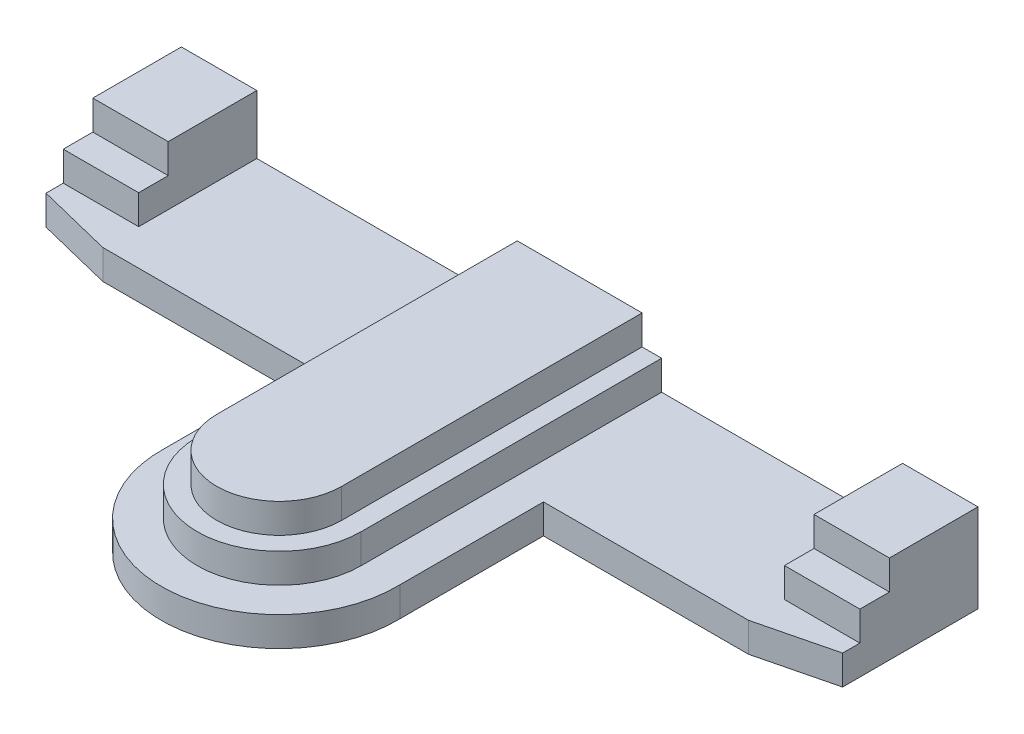
ISO-10303-21;
HEADER;
FILE_DESCRIPTION(('STEP AP214'),'2;1');
FILE_NAME('part.step','',(''),(''),'','','');
FILE_SCHEMA(('AUTOMOTIVE_DESIGN { 1 0 10303 214 1 1 1 1 }'));
ENDSEC;
DATA;
#1=APPLICATION_CONTEXT('core data for automotive mechanical design processes');
#2=APPLICATION_PROTOCOL_DEFINITION('international standard','automotive_design',2000,#1);
#3=PRODUCT_CONTEXT('',#1,'mechanical');
#4=PRODUCT('Part','Part','',(#3));
#5=PRODUCT_RELATED_PRODUCT_CATEGORY('part','',(#4));
#6=PRODUCT_DEFINITION_FORMATION('','',#4);
#7=PRODUCT_DEFINITION_CONTEXT('part definition',#1,'design');
#8=PRODUCT_DEFINITION('design','',#6,#7);
#9=PRODUCT_DEFINITION_SHAPE('','',#8);
#10=(LENGTH_UNIT() NAMED_UNIT(*) SI_UNIT(.MILLI.,.METRE.));
#11=(NAMED_UNIT(*) PLANE_ANGLE_UNIT() SI_UNIT($,.RADIAN.));
#12=(NAMED_UNIT(*) SI_UNIT($,.STERADIAN.) SOLID_ANGLE_UNIT());
#13=UNCERTAINTY_MEASURE_WITH_UNIT(LENGTH_MEASURE(1.E-05),#10,'distance_accuracy_value','');
#14=(GEOMETRIC_REPRESENTATION_CONTEXT(3) GLOBAL_UNCERTAINTY_ASSIGNED_CONTEXT((#13)) GLOBAL_UNIT_ASSIGNED_CONTEXT((#10,
#11,#12)) REPRESENTATION_CONTEXT('',''));
#15=CARTESIAN_POINT('',(0.,0.,0.));
#16=DIRECTION('',(0.,0.,1.));
#17=DIRECTION('',(1.,0.,0.));
#18=AXIS2_PLACEMENT_3D('',#15,#16,#17);
#19=CARTESIAN_POINT('',(59.1914661779905,-43.9359974390858,-29.7525439278961));
#20=DIRECTION('',(0.,0.,-1.));
#21=DIRECTION('',(-1.,0.,0.));
#22=AXIS2_PLACEMENT_3D('',#19,#20,#21);
#23=PLANE('',#22);
#24=DIRECTION('',(0.,-1.,0.));
#25=VECTOR('',#24,1.);
#26=CARTESIAN_POINT('',(-31.4865338220095,-43.9359974390858,-29.7525439278961));
#27=LINE('',#26,#25);
#28=CARTESIAN_POINT('',(-31.4865338220095,19.4497025609142,-29.7525439278961));
#29=VERTEX_POINT('',#28);
#30=CARTESIAN_POINT('',(-31.4865338220095,13.0997025609142,-29.7525439278961));
#31=VERTEX_POINT('',#30);
#32=EDGE_CURVE('E42',#29,#31,#27,.T.);
#33=ORIENTED_EDGE('',*,*,#32,.T.);
#34=DIRECTION('',(-1.,0.,0.));
#35=VECTOR('',#34,1.);
#36=CARTESIAN_POINT('',(-66.5385338220095,13.0997025609142,-29.7525439278961));
#37=LINE('',#36,#35);
#38=CARTESIAN_POINT('',(-5.51972883231249,13.0997025609142,-29.7525439278961));
#39=VERTEX_POINT('',#38);
#40=EDGE_CURVE('E248',#39,#31,#37,.T.);
#41=ORIENTED_EDGE('',*,*,#40,.F.);
#42=DIRECTION('',(0.,1.,0.));
#43=VECTOR('',#42,1.);
#44=CARTESIAN_POINT('',(-5.51972883231249,13.0997025609142,-29.7525439278961));
#45=LINE('',#44,#43);
#46=CARTESIAN_POINT('',(-5.51972883231249,16.2747025609142,-29.7525439278961));
#47=VERTEX_POINT('',#46);
#48=EDGE_CURVE('E350',#39,#47,#45,.T.);
#49=ORIENTED_EDGE('',*,*,#48,.T.);
#50=DIRECTION('',(-1.,0.,0.));
#51=VECTOR('',#50,1.);
#52=CARTESIAN_POINT('',(-66.5385338220095,16.2747025609142,-29.7525439278961));
#53=LINE('',#52,#51);
#54=CARTESIAN_POINT('',(-3.41520724280228,16.2747025609142,-29.7525439278961));
#55=VERTEX_POINT('',#54);
#56=EDGE_CURVE('E579',#55,#47,#53,.T.);
#57=ORIENTED_EDGE('',*,*,#56,.F.);
#58=DIRECTION('',(0.,1.,0.));
#59=VECTOR('',#58,1.);
#60=CARTESIAN_POINT('',(-3.41520724280227,-43.9359974390858,-29.7525439278961));
#61=LINE('',#60,#59);
#62=CARTESIAN_POINT('',(-3.41520724280225,19.4497025609142,-29.7525439278961));
#63=VERTEX_POINT('',#62);
#64=EDGE_CURVE('E554',#55,#63,#61,.T.);
#65=ORIENTED_EDGE('',*,*,#64,.T.);
#66=DIRECTION('',(-1.,0.,0.));
#67=VECTOR('',#66,1.);
#68=CARTESIAN_POINT('',(59.1914661779905,19.4497025609142,-29.7525439278961));
#69=LINE('',#68,#67);
#70=CARTESIAN_POINT('',(10.0381395987833,19.4497025609142,-29.7525439278961));
#71=VERTEX_POINT('',#70);
#72=EDGE_CURVE('E552',#71,#63,#69,.T.);
#73=ORIENTED_EDGE('',*,*,#72,.F.);
#74=DIRECTION('',(0.,1.,0.));
#75=VECTOR('',#74,1.);
#76=CARTESIAN_POINT('',(10.0381395987833,16.2747025609142,-29.7525439278961));
#77=LINE('',#76,#75);
#78=CARTESIAN_POINT('',(10.0381395987833,16.2747025609142,-29.7525439278961));
#79=VERTEX_POINT('',#78);
#80=EDGE_CURVE('E567',#79,#71,#77,.T.);
#81=ORIENTED_EDGE('',*,*,#80,.F.);
#82=CARTESIAN_POINT('',(12.1426611882934,16.2747025609142,-29.7525439278961));
#83=VERTEX_POINT('',#82);
#84=EDGE_CURVE('E608',#83,#79,#53,.T.);
#85=ORIENTED_EDGE('',*,*,#84,.F.);
#86=DIRECTION('',(0.,1.,0.));
#87=VECTOR('',#86,1.);
#88=CARTESIAN_POINT('',(12.1426611882934,13.0997025609142,-29.7525439278961));
#89=LINE('',#88,#87);
#90=CARTESIAN_POINT('',(12.1426611882934,13.0997025609142,-29.7525439278961));
#91=VERTEX_POINT('',#90);
#92=EDGE_CURVE('E611',#91,#83,#89,.T.);
#93=ORIENTED_EDGE('',*,*,#92,.F.);
#94=CARTESIAN_POINT('',(38.1094661779905,13.0997025609142,-29.7525439278961));
#95=VERTEX_POINT('',#94);
#96=EDGE_CURVE('E252',#95,#91,#37,.T.);
#97=ORIENTED_EDGE('',*,*,#96,.F.);
#98=DIRECTION('',(0.,1.,0.));
#99=VECTOR('',#98,1.);
#100=CARTESIAN_POINT('',(38.1094661779905,-43.9359974390858,-29.7525439278961));
#101=LINE('',#100,#99);
#102=CARTESIAN_POINT('',(38.1094661779905,19.4497025609142,-29.7525439278961));
#103=VERTEX_POINT('',#102);
#104=EDGE_CURVE('E349',#95,#103,#101,.T.);
#105=ORIENTED_EDGE('',*,*,#104,.T.);
#106=DIRECTION('',(-1.,0.,0.));
#107=VECTOR('',#106,1.);
#108=CARTESIAN_POINT('',(59.1914661779905,19.4497025609142,-29.7525439278961));
#109=LINE('',#108,#107);
#110=CARTESIAN_POINT('',(46.2374661779905,19.4497025609142,-29.7525439278961));
#111=VERTEX_POINT('',#110);
#112=EDGE_CURVE('E351',#111,#103,#109,.T.);
#113=ORIENTED_EDGE('',*,*,#112,.F.);
#114=DIRECTION('',(0.,1.,0.));
#115=VECTOR('',#114,1.);
#116=CARTESIAN_POINT('',(46.2374661779905,16.2747025609142,-29.7525439278961));
#117=LINE('',#116,#115);
#118=CARTESIAN_POINT('',(46.2374661779905,9.92470256091423,-29.7525439278961));
#119=VERTEX_POINT('',#118);
#120=EDGE_CURVE('E346',#119,#111,#117,.T.);
#121=ORIENTED_EDGE('',*,*,#120,.F.);
#122=DIRECTION('',(1.,0.,0.));
#123=VECTOR('',#122,1.);
#124=CARTESIAN_POINT('',(59.1914661779905,9.9247025609142,-29.7525439278961));
#125=LINE('',#124,#123);
#126=CARTESIAN_POINT('',(-39.6145338220095,9.92470256091423,-29.7525439278961));
#127=VERTEX_POINT('',#126);
#128=EDGE_CURVE('E467',#127,#119,#125,.T.);
#129=ORIENTED_EDGE('',*,*,#128,.F.);
#130=DIRECTION('',(0.,1.,0.));
#131=VECTOR('',#130,1.);
#132=CARTESIAN_POINT('',(-39.6145338220095,-43.9359974390858,-29.7525439278961));
#133=LINE('',#132,#131);
#134=CARTESIAN_POINT('',(-39.6145338220095,19.4497025609142,-29.7525439278961));
#135=VERTEX_POINT('',#134);
#136=EDGE_CURVE('E458',#127,#135,#133,.T.);
#137=ORIENTED_EDGE('',*,*,#136,.T.);
#138=DIRECTION('',(-1.,0.,0.));
#139=VECTOR('',#138,1.);
#140=CARTESIAN_POINT('',(59.1914661779905,19.4497025609142,-29.7525439278961));
#141=LINE('',#140,#139);
#142=EDGE_CURVE('E11',#29,#135,#141,.T.);
#143=ORIENTED_EDGE('',*,*,#142,.F.);
#144=EDGE_LOOP('',(#33,#41,#49,#57,#65,#73,#81,#85,#93,#97,#105,#113,#121,#129,#137,#143));
#145=FACE_BOUND('',#144,.T.);
#146=ADVANCED_FACE('F34',(#145),#23,.T.);
#147=CARTESIAN_POINT('',(-31.4865338220095,16.2747025609142,-29.7525439278961));
#148=DIRECTION('',(1.,0.,0.));
#149=DIRECTION('',(0.,0.,-1.));
#150=AXIS2_PLACEMENT_3D('',#147,#148,#149);
#151=PLANE('',#150);
#152=DIRECTION('',(0.,1.,0.));
#153=VECTOR('',#152,1.);
#154=CARTESIAN_POINT('',(-31.4865338220095,16.2747025609142,-20.2064007276293));
#155=LINE('',#154,#153);
#156=CARTESIAN_POINT('',(-31.4865338220095,16.2747025609142,-20.2064007276293));
#157=VERTEX_POINT('',#156);
#158=CARTESIAN_POINT('',(-31.4865338220095,19.4497025609142,-20.2064007276022));
#159=VERTEX_POINT('',#158);
#160=EDGE_CURVE('E538',#157,#159,#155,.T.);
#161=ORIENTED_EDGE('',*,*,#160,.F.);
#162=DIRECTION('',(0.,0.,-1.));
#163=VECTOR('',#162,1.);
#164=CARTESIAN_POINT('',(-31.4865338220095,16.2747025609142,-29.7525439278961));
#165=LINE('',#164,#163);
#166=CARTESIAN_POINT('',(-31.4865338220095,16.2747025609142,-17.0208335164863));
#167=VERTEX_POINT('',#166);
#168=EDGE_CURVE('E50',#167,#157,#165,.T.);
#169=ORIENTED_EDGE('',*,*,#168,.F.);
#170=DIRECTION('',(0.,1.,0.));
#171=VECTOR('',#170,1.);
#172=CARTESIAN_POINT('',(-31.4865338220095,13.0997025609142,-17.0208335164863));
#173=LINE('',#172,#171);
#174=CARTESIAN_POINT('',(-31.4865338220095,13.0997025609142,-17.0208335164863));
#175=VERTEX_POINT('',#174);
#176=EDGE_CURVE('E512',#175,#167,#173,.T.);
#177=ORIENTED_EDGE('',*,*,#176,.F.);
#178=DIRECTION('',(0.,0.,-1.));
#179=VECTOR('',#178,1.);
#180=CARTESIAN_POINT('',(-31.4865338220095,13.0997025609142,-29.7525439278961));
#181=LINE('',#180,#179);
#182=EDGE_CURVE('E520',#175,#31,#181,.T.);
#183=ORIENTED_EDGE('',*,*,#182,.T.);
#184=ORIENTED_EDGE('',*,*,#32,.F.);
#185=DIRECTION('',(0.,0.,1.));
#186=VECTOR('',#185,1.);
#187=CARTESIAN_POINT('',(-31.4865338220095,19.4497025609142,500000.));
#188=LINE('',#187,#186);
#189=EDGE_CURVE('E545',#29,#159,#188,.T.);
#190=ORIENTED_EDGE('',*,*,#189,.T.);
#191=EDGE_LOOP('',(#161,#169,#177,#183,#184,#190));
#192=FACE_BOUND('',#191,.T.);
#193=ADVANCED_FACE('F451',(#192),#151,.T.);
#194=CARTESIAN_POINT('',(-39.6145338220095,16.2747025609142,-20.2064007276293));
#195=DIRECTION('',(-1.,0.,0.));
#196=DIRECTION('',(0.,0.,1.));
#197=AXIS2_PLACEMENT_3D('',#194,#195,#196);
#198=PLANE('',#197);
#199=ORIENTED_EDGE('',*,*,#136,.F.);
#200=DIRECTION('',(0.,0.,1.));
#201=VECTOR('',#200,1.);
#202=CARTESIAN_POINT('',(-39.6145338220095,9.92470256091422,-15.1613548056895));
#203=LINE('',#202,#201);
#204=CARTESIAN_POINT('',(-39.6145338220095,9.92470256091422,-15.1613548056895));
#205=VERTEX_POINT('',#204);
#206=EDGE_CURVE('E293',#127,#205,#203,.T.);
#207=ORIENTED_EDGE('',*,*,#206,.T.);
#208=DIRECTION('',(0.,1.,0.));
#209=VECTOR('',#208,1.);
#210=CARTESIAN_POINT('',(-39.6145338220095,9.92470256091422,-15.1613548056895));
#211=LINE('',#210,#209);
#212=CARTESIAN_POINT('',(-39.6145338220095,13.0997025609142,-15.1613548056895));
#213=VERTEX_POINT('',#212);
#214=EDGE_CURVE('E290',#205,#213,#211,.T.);
#215=ORIENTED_EDGE('',*,*,#214,.T.);
#216=DIRECTION('',(0.,0.,1.));
#217=VECTOR('',#216,1.);
#218=CARTESIAN_POINT('',(-39.6145338220095,13.0997025609142,-15.1613548056895));
#219=LINE('',#218,#217);
#220=CARTESIAN_POINT('',(-39.6145338220095,13.0997025609142,-17.0208335164863));
#221=VERTEX_POINT('',#220);
#222=EDGE_CURVE('E470',#221,#213,#219,.T.);
#223=ORIENTED_EDGE('',*,*,#222,.F.);
#224=DIRECTION('',(0.,1.,0.));
#225=VECTOR('',#224,1.);
#226=CARTESIAN_POINT('',(-39.6145338220095,13.0997025609142,-17.0208335164863));
#227=LINE('',#226,#225);
#228=CARTESIAN_POINT('',(-39.6145338220095,16.2747025609142,-17.0208335164863));
#229=VERTEX_POINT('',#228);
#230=EDGE_CURVE('E499',#221,#229,#227,.T.);
#231=ORIENTED_EDGE('',*,*,#230,.T.);
#232=DIRECTION('',(0.,0.,1.));
#233=VECTOR('',#232,1.);
#234=CARTESIAN_POINT('',(-39.6145338220095,16.2747025609142,-17.0208335164863));
#235=LINE('',#234,#233);
#236=CARTESIAN_POINT('',(-39.6145338220095,16.2747025609142,-20.2064007276293));
#237=VERTEX_POINT('',#236);
#238=EDGE_CURVE('E525',#237,#229,#235,.T.);
#239=ORIENTED_EDGE('',*,*,#238,.F.);
#240=DIRECTION('',(0.,1.,0.));
#241=VECTOR('',#240,1.);
#242=CARTESIAN_POINT('',(-39.6145338220095,16.2747025609142,-20.2064007276293));
#243=LINE('',#242,#241);
#244=CARTESIAN_POINT('',(-39.6145338220095,19.4497025609142,-20.2064007276022));
#245=VERTEX_POINT('',#244);
#246=EDGE_CURVE('E542',#237,#245,#243,.T.);
#247=ORIENTED_EDGE('',*,*,#246,.T.);
#248=DIRECTION('',(0.,0.,1.));
#249=VECTOR('',#248,1.);
#250=CARTESIAN_POINT('',(-39.6145338220095,19.4497025609142,-20.2064007276293));
#251=LINE('',#250,#249);
#252=EDGE_CURVE('E462',#135,#245,#251,.T.);
#253=ORIENTED_EDGE('',*,*,#252,.F.);
#254=EDGE_LOOP('',(#199,#207,#215,#223,#231,#239,#247,#253));
#255=FACE_BOUND('',#254,.T.);
#256=ADVANCED_FACE('F446',(#255),#198,.T.);
#257=CARTESIAN_POINT('',(-38.8525338220095,16.2747025609142,-20.2064007276293));
#258=DIRECTION('',(0.,0.,1.));
#259=DIRECTION('',(1.,0.,0.));
#260=AXIS2_PLACEMENT_3D('',#257,#258,#259);
#261=PLANE('',#260);
#262=DIRECTION('',(-1.,0.,0.));
#263=VECTOR('',#262,1.);
#264=CARTESIAN_POINT('',(59.1914661779905,19.4497025609142,-20.2064007276022));
#265=LINE('',#264,#263);
#266=EDGE_CURVE('E547',#159,#245,#265,.T.);
#267=ORIENTED_EDGE('',*,*,#266,.T.);
#268=ORIENTED_EDGE('',*,*,#246,.F.);
#269=DIRECTION('',(1.,0.,0.));
#270=VECTOR('',#269,1.);
#271=CARTESIAN_POINT('',(-38.8525338220095,16.2747025609142,-20.2064007276293));
#272=LINE('',#271,#270);
#273=EDGE_CURVE('E543',#237,#157,#272,.T.);
#274=ORIENTED_EDGE('',*,*,#273,.T.);
#275=ORIENTED_EDGE('',*,*,#160,.T.);
#276=EDGE_LOOP('',(#267,#268,#274,#275));
#277=FACE_BOUND('',#276,.T.);
#278=ADVANCED_FACE('F434',(#277),#261,.T.);
#279=CARTESIAN_POINT('',(59.1914661779905,19.4497025609142,500000.));
#280=DIRECTION('',(0.,-1.,0.));
#281=DIRECTION('',(1.,0.,0.));
#282=AXIS2_PLACEMENT_3D('',#279,#280,#281);
#283=PLANE('',#282);
#284=ORIENTED_EDGE('',*,*,#142,.T.);
#285=ORIENTED_EDGE('',*,*,#252,.T.);
#286=ORIENTED_EDGE('',*,*,#266,.F.);
#287=ORIENTED_EDGE('',*,*,#189,.F.);
#288=EDGE_LOOP('',(#284,#285,#286,#287));
#289=FACE_BOUND('',#288,.T.);
#290=ADVANCED_FACE('F431',(#289),#283,.F.);
#291=CARTESIAN_POINT('',(59.1914661779905,19.4497025609142,500000.));
#292=DIRECTION('',(0.,-1.,0.));
#293=DIRECTION('',(1.,0.,0.));
#294=AXIS2_PLACEMENT_3D('',#291,#292,#293);
#295=PLANE('',#294);
#296=DIRECTION('',(0.,0.,-1.));
#297=VECTOR('',#296,1.);
#298=CARTESIAN_POINT('',(10.0381395987833,19.4497025609142,2.63245607210388));
#299=LINE('',#298,#297);
#300=CARTESIAN_POINT('',(10.0381395987833,19.4497025609142,2.63245607210388));
#301=VERTEX_POINT('',#300);
#302=EDGE_CURVE('E558',#71,#301,#299,.F.);
#303=ORIENTED_EDGE('',*,*,#302,.F.);
#304=ORIENTED_EDGE('',*,*,#72,.T.);
#305=DIRECTION('',(0.,0.,-1.));
#306=VECTOR('',#305,1.);
#307=CARTESIAN_POINT('',(-3.41520724280228,19.4497025609142,2.63245607210388));
#308=LINE('',#307,#306);
#309=CARTESIAN_POINT('',(-3.41520724280227,19.4497025609142,2.63245607210388));
#310=VERTEX_POINT('',#309);
#311=EDGE_CURVE('E562',#310,#63,#308,.T.);
#312=ORIENTED_EDGE('',*,*,#311,.F.);
#313=CARTESIAN_POINT('',(3.3114661779905,19.4497025609142,2.63245607210388));
#314=DIRECTION('',(0.,1.,0.));
#315=DIRECTION('',(0.,0.,1.));
#316=AXIS2_PLACEMENT_3D('',#313,#314,#315);
#317=CIRCLE('',#316,6.72667342079277);
#318=EDGE_CURVE('E574',#301,#310,#317,.F.);
#319=ORIENTED_EDGE('',*,*,#318,.F.);
#320=EDGE_LOOP('',(#303,#304,#312,#319));
#321=FACE_BOUND('',#320,.T.);
#322=ADVANCED_FACE('F433',(#321),#295,.F.);
#323=CARTESIAN_POINT('',(10.0381395987833,16.2747025609142,2.63245607210388));
#324=DIRECTION('',(1.,0.,0.));
#325=DIRECTION('',(0.,0.,-1.));
#326=AXIS2_PLACEMENT_3D('',#323,#324,#325);
#327=PLANE('',#326);
#328=ORIENTED_EDGE('',*,*,#302,.T.);
#329=DIRECTION('',(0.,1.,0.));
#330=VECTOR('',#329,1.);
#331=CARTESIAN_POINT('',(10.0381395987833,16.2747025609142,2.63245607210388));
#332=LINE('',#331,#330);
#333=CARTESIAN_POINT('',(10.0381395987833,16.2747025609142,2.63245607210388));
#334=VERTEX_POINT('',#333);
#335=EDGE_CURVE('E510',#334,#301,#332,.T.);
#336=ORIENTED_EDGE('',*,*,#335,.F.);
#337=DIRECTION('',(0.,0.,-1.));
#338=VECTOR('',#337,1.);
#339=CARTESIAN_POINT('',(10.0381395987833,16.2747025609142,2.63245607210388));
#340=LINE('',#339,#338);
#341=EDGE_CURVE('E507',#334,#79,#340,.T.);
#342=ORIENTED_EDGE('',*,*,#341,.T.);
#343=ORIENTED_EDGE('',*,*,#80,.T.);
#344=EDGE_LOOP('',(#328,#336,#342,#343));
#345=FACE_BOUND('',#344,.T.);
#346=ADVANCED_FACE('F441',(#345),#327,.T.);
#347=CARTESIAN_POINT('',(-3.41520724280228,16.2747025609142,-29.7525439278961));
#348=DIRECTION('',(-1.,0.,0.));
#349=DIRECTION('',(0.,0.,1.));
#350=AXIS2_PLACEMENT_3D('',#347,#348,#349);
#351=PLANE('',#350);
#352=ORIENTED_EDGE('',*,*,#311,.T.);
#353=ORIENTED_EDGE('',*,*,#64,.F.);
#354=DIRECTION('',(0.,0.,1.));
#355=VECTOR('',#354,1.);
#356=CARTESIAN_POINT('',(-3.41520724280228,16.2747025609142,-29.7525439278961));
#357=LINE('',#356,#355);
#358=CARTESIAN_POINT('',(-3.41520724280227,16.2747025609142,2.63245607210388));
#359=VERTEX_POINT('',#358);
#360=EDGE_CURVE('E569',#55,#359,#357,.T.);
#361=ORIENTED_EDGE('',*,*,#360,.T.);
#362=DIRECTION('',(0.,1.,0.));
#363=VECTOR('',#362,1.);
#364=CARTESIAN_POINT('',(-3.41520724280227,16.2747025609142,2.63245607210388));
#365=LINE('',#364,#363);
#366=EDGE_CURVE('E585',#359,#310,#365,.T.);
#367=ORIENTED_EDGE('',*,*,#366,.T.);
#368=EDGE_LOOP('',(#352,#353,#361,#367));
#369=FACE_BOUND('',#368,.T.);
#370=ADVANCED_FACE('F605',(#369),#351,.T.);
#371=CARTESIAN_POINT('',(3.3114661779905,16.2747025609142,2.63245607210388));
#372=DIRECTION('',(0.,1.,0.));
#373=DIRECTION('',(0.,0.,1.));
#374=AXIS2_PLACEMENT_3D('',#371,#372,#373);
#375=CYLINDRICAL_SURFACE('',#374,6.72667342079278);
#376=ORIENTED_EDGE('',*,*,#318,.T.);
#377=ORIENTED_EDGE('',*,*,#366,.F.);
#378=CARTESIAN_POINT('',(3.3114661779905,16.2747025609142,2.63245607210388));
#379=DIRECTION('',(0.,1.,0.));
#380=DIRECTION('',(0.,0.,1.));
#381=AXIS2_PLACEMENT_3D('',#378,#379,#380);
#382=CIRCLE('',#381,6.72667342079278);
#383=EDGE_CURVE('E588',#359,#334,#382,.T.);
#384=ORIENTED_EDGE('',*,*,#383,.T.);
#385=ORIENTED_EDGE('',*,*,#335,.T.);
#386=EDGE_LOOP('',(#376,#377,#384,#385));
#387=FACE_BOUND('',#386,.T.);
#388=ADVANCED_FACE('F445',(#387),#375,.T.);
#389=CARTESIAN_POINT('',(-58.3130040874096,16.2747025609142,26.1374810721039));
#390=DIRECTION('',(0.,1.,0.));
#391=DIRECTION('',(0.,0.,1.));
#392=AXIS2_PLACEMENT_3D('',#389,#390,#391);
#393=PLANE('',#392);
#394=ORIENTED_EDGE('',*,*,#168,.T.);
#395=ORIENTED_EDGE('',*,*,#273,.F.);
#396=ORIENTED_EDGE('',*,*,#238,.T.);
#397=DIRECTION('',(-1.,0.,0.));
#398=VECTOR('',#397,1.);
#399=CARTESIAN_POINT('',(-32.2485338220095,16.2747025609142,-17.0208335164863));
#400=LINE('',#399,#398);
#401=EDGE_CURVE('E506',#167,#229,#400,.T.);
#402=ORIENTED_EDGE('',*,*,#401,.F.);
#403=EDGE_LOOP('',(#394,#395,#396,#402));
#404=FACE_BOUND('',#403,.T.);
#405=ADVANCED_FACE('F444',(#404),#393,.T.);
#406=CARTESIAN_POINT('',(-38.8525338220095,13.0997025609142,-17.0208335164863));
#407=DIRECTION('',(0.,0.,1.));
#408=DIRECTION('',(1.,0.,0.));
#409=AXIS2_PLACEMENT_3D('',#406,#407,#408);
#410=PLANE('',#409);
#411=ORIENTED_EDGE('',*,*,#401,.T.);
#412=ORIENTED_EDGE('',*,*,#230,.F.);
#413=DIRECTION('',(1.,0.,0.));
#414=VECTOR('',#413,1.);
#415=CARTESIAN_POINT('',(-38.8525338220095,13.0997025609142,-17.0208335164863));
#416=LINE('',#415,#414);
#417=EDGE_CURVE('E504',#221,#175,#416,.T.);
#418=ORIENTED_EDGE('',*,*,#417,.T.);
#419=ORIENTED_EDGE('',*,*,#176,.T.);
#420=EDGE_LOOP('',(#411,#412,#418,#419));
#421=FACE_BOUND('',#420,.T.);
#422=ADVANCED_FACE('F503',(#421),#410,.T.);
#423=CARTESIAN_POINT('',(38.1094661779905,16.2747025609142,-29.7525439278961));
#424=DIRECTION('',(-1.,0.,0.));
#425=DIRECTION('',(0.,0.,1.));
#426=AXIS2_PLACEMENT_3D('',#423,#424,#425);
#427=PLANE('',#426);
#428=ORIENTED_EDGE('',*,*,#104,.F.);
#429=DIRECTION('',(0.,0.,1.));
#430=VECTOR('',#429,1.);
#431=CARTESIAN_POINT('',(38.1094661779905,13.0997025609142,-29.7525439278961));
#432=LINE('',#431,#430);
#433=CARTESIAN_POINT('',(38.1094661779905,13.0997025609142,-17.0208335164863));
#434=VERTEX_POINT('',#433);
#435=EDGE_CURVE('E305',#95,#434,#432,.T.);
#436=ORIENTED_EDGE('',*,*,#435,.T.);
#437=DIRECTION('',(0.,1.,0.));
#438=VECTOR('',#437,1.);
#439=CARTESIAN_POINT('',(38.1094661779905,13.0997025609142,-17.0208335164863));
#440=LINE('',#439,#438);
#441=CARTESIAN_POINT('',(38.1094661779905,16.2747025609142,-17.0208335164863));
#442=VERTEX_POINT('',#441);
#443=EDGE_CURVE('E345',#434,#442,#440,.T.);
#444=ORIENTED_EDGE('',*,*,#443,.T.);
#445=DIRECTION('',(0.,0.,1.));
#446=VECTOR('',#445,1.);
#447=CARTESIAN_POINT('',(38.1094661779905,16.2747025609142,-29.7525439278961));
#448=LINE('',#447,#446);
#449=CARTESIAN_POINT('',(38.1094661779905,16.2747025609142,-20.2064007276293));
#450=VERTEX_POINT('',#449);
#451=EDGE_CURVE('E310',#450,#442,#448,.T.);
#452=ORIENTED_EDGE('',*,*,#451,.F.);
#453=DIRECTION('',(0.,1.,0.));
#454=VECTOR('',#453,1.);
#455=CARTESIAN_POINT('',(38.1094661779905,16.2747025609142,-20.2064007276293));
#456=LINE('',#455,#454);
#457=CARTESIAN_POINT('',(38.1094661779905,19.4497025609142,-20.2064007276293));
#458=VERTEX_POINT('',#457);
#459=EDGE_CURVE('E365',#450,#458,#456,.T.);
#460=ORIENTED_EDGE('',*,*,#459,.T.);
#461=DIRECTION('',(0.,0.,1.));
#462=VECTOR('',#461,1.);
#463=CARTESIAN_POINT('',(38.1094661779905,19.4497025609142,-29.7525439278961));
#464=LINE('',#463,#462);
#465=EDGE_CURVE('E369',#103,#458,#464,.T.);
#466=ORIENTED_EDGE('',*,*,#465,.F.);
#467=EDGE_LOOP('',(#428,#436,#444,#452,#460,#466));
#468=FACE_BOUND('',#467,.T.);
#469=ADVANCED_FACE('F385',(#468),#427,.T.);
#470=CARTESIAN_POINT('',(38.8714661779905,16.2747025609142,-20.2064007276293));
#471=DIRECTION('',(0.,0.,1.));
#472=DIRECTION('',(1.,0.,0.));
#473=AXIS2_PLACEMENT_3D('',#470,#471,#472);
#474=PLANE('',#473);
#475=DIRECTION('',(1.,0.,0.));
#476=VECTOR('',#475,1.);
#477=CARTESIAN_POINT('',(38.8714661779905,19.4497025609142,-20.2064007276293));
#478=LINE('',#477,#476);
#479=CARTESIAN_POINT('',(46.2374661779905,19.4497025609142,-20.2064007276293));
#480=VERTEX_POINT('',#479);
#481=EDGE_CURVE('E374',#458,#480,#478,.T.);
#482=ORIENTED_EDGE('',*,*,#481,.F.);
#483=ORIENTED_EDGE('',*,*,#459,.F.);
#484=DIRECTION('',(1.,0.,0.));
#485=VECTOR('',#484,1.);
#486=CARTESIAN_POINT('',(38.8714661779905,16.2747025609142,-20.2064007276293));
#487=LINE('',#486,#485);
#488=CARTESIAN_POINT('',(46.2374661779905,16.2747025609142,-20.2064007276293));
#489=VERTEX_POINT('',#488);
#490=EDGE_CURVE('E362',#450,#489,#487,.T.);
#491=ORIENTED_EDGE('',*,*,#490,.T.);
#492=DIRECTION('',(0.,1.,0.));
#493=VECTOR('',#492,1.);
#494=CARTESIAN_POINT('',(46.2374661779905,16.2747025609142,-20.2064007276293));
#495=LINE('',#494,#493);
#496=EDGE_CURVE('E366',#489,#480,#495,.T.);
#497=ORIENTED_EDGE('',*,*,#496,.T.);
#498=EDGE_LOOP('',(#482,#483,#491,#497));
#499=FACE_BOUND('',#498,.T.);
#500=ADVANCED_FACE('F390',(#499),#474,.T.);
#501=CARTESIAN_POINT('',(46.2374661779905,16.2747025609142,-20.2064007276293));
#502=DIRECTION('',(1.,0.,0.));
#503=DIRECTION('',(0.,0.,-1.));
#504=AXIS2_PLACEMENT_3D('',#501,#502,#503);
#505=PLANE('',#504);
#506=ORIENTED_EDGE('',*,*,#496,.F.);
#507=DIRECTION('',(0.,0.,-1.));
#508=VECTOR('',#507,1.);
#509=CARTESIAN_POINT('',(46.2374661779905,16.2747025609142,-17.0208335164863));
#510=LINE('',#509,#508);
#511=CARTESIAN_POINT('',(46.2374661779905,16.2747025609142,-17.0208335164863));
#512=VERTEX_POINT('',#511);
#513=EDGE_CURVE('E407',#512,#489,#510,.T.);
#514=ORIENTED_EDGE('',*,*,#513,.F.);
#515=DIRECTION('',(0.,1.,0.));
#516=VECTOR('',#515,1.);
#517=CARTESIAN_POINT('',(46.2374661779905,13.0997025609142,-17.0208335164863));
#518=LINE('',#517,#516);
#519=CARTESIAN_POINT('',(46.2374661779905,13.0997025609142,-17.0208335164863));
#520=VERTEX_POINT('',#519);
#521=EDGE_CURVE('E311',#520,#512,#518,.T.);
#522=ORIENTED_EDGE('',*,*,#521,.F.);
#523=DIRECTION('',(0.,0.,-1.));
#524=VECTOR('',#523,1.);
#525=CARTESIAN_POINT('',(46.2374661779905,13.0997025609142,-15.1613548056895));
#526=LINE('',#525,#524);
#527=CARTESIAN_POINT('',(46.2374661779905,13.0997025609142,-15.1613548056895));
#528=VERTEX_POINT('',#527);
#529=EDGE_CURVE('E287',#528,#520,#526,.T.);
#530=ORIENTED_EDGE('',*,*,#529,.F.);
#531=DIRECTION('',(0.,1.,0.));
#532=VECTOR('',#531,1.);
#533=CARTESIAN_POINT('',(46.2374661779905,9.92470256091422,-15.1613548056895));
#534=LINE('',#533,#532);
#535=CARTESIAN_POINT('',(46.2374661779905,9.92470256091422,-15.1613548056895));
#536=VERTEX_POINT('',#535);
#537=EDGE_CURVE('E268',#536,#528,#534,.T.);
#538=ORIENTED_EDGE('',*,*,#537,.F.);
#539=DIRECTION('',(0.,0.,-1.));
#540=VECTOR('',#539,1.);
#541=CARTESIAN_POINT('',(46.2374661779905,9.92470256091422,-15.1613548056895));
#542=LINE('',#541,#540);
#543=EDGE_CURVE('E271',#536,#119,#542,.T.);
#544=ORIENTED_EDGE('',*,*,#543,.T.);
#545=ORIENTED_EDGE('',*,*,#120,.T.);
#546=DIRECTION('',(0.,0.,-1.));
#547=VECTOR('',#546,1.);
#548=CARTESIAN_POINT('',(46.2374661779905,19.4497025609142,-20.2064007276293));
#549=LINE('',#548,#547);
#550=EDGE_CURVE('E370',#480,#111,#549,.T.);
#551=ORIENTED_EDGE('',*,*,#550,.F.);
#552=EDGE_LOOP('',(#506,#514,#522,#530,#538,#544,#545,#551));
#553=FACE_BOUND('',#552,.T.);
#554=ADVANCED_FACE('F405',(#553),#505,.T.);
#555=CARTESIAN_POINT('',(59.1914661779905,19.4497025609142,500000.));
#556=DIRECTION('',(0.,-1.,0.));
#557=DIRECTION('',(1.,0.,0.));
#558=AXIS2_PLACEMENT_3D('',#555,#556,#557);
#559=PLANE('',#558);
#560=ORIENTED_EDGE('',*,*,#112,.T.);
#561=ORIENTED_EDGE('',*,*,#465,.T.);
#562=ORIENTED_EDGE('',*,*,#481,.T.);
#563=ORIENTED_EDGE('',*,*,#550,.T.);
#564=EDGE_LOOP('',(#560,#561,#562,#563));
#565=FACE_BOUND('',#564,.T.);
#566=ADVANCED_FACE('F379',(#565),#559,.F.);
#567=CARTESIAN_POINT('',(12.1426611882934,13.0997025609142,2.63245607210388));
#568=DIRECTION('',(1.,0.,0.));
#569=DIRECTION('',(0.,0.,-1.));
#570=AXIS2_PLACEMENT_3D('',#567,#568,#569);
#571=PLANE('',#570);
#572=DIRECTION('',(0.,0.,-1.));
#573=VECTOR('',#572,1.);
#574=CARTESIAN_POINT('',(12.1426611882934,16.2747025609142,2.63245607210388));
#575=LINE('',#574,#573);
#576=CARTESIAN_POINT('',(12.1426611882934,16.2747025609142,2.63245607210388));
#577=VERTEX_POINT('',#576);
#578=EDGE_CURVE('E323',#83,#577,#575,.F.);
#579=ORIENTED_EDGE('',*,*,#578,.T.);
#580=DIRECTION('',(0.,1.,0.));
#581=VECTOR('',#580,1.);
#582=CARTESIAN_POINT('',(12.1426611882934,13.0997025609142,2.63245607210388));
#583=LINE('',#582,#581);
#584=CARTESIAN_POINT('',(12.1426611882934,13.0997025609142,2.63245607210388));
#585=VERTEX_POINT('',#584);
#586=EDGE_CURVE('E613',#585,#577,#583,.T.);
#587=ORIENTED_EDGE('',*,*,#586,.F.);
#588=DIRECTION('',(0.,0.,-1.));
#589=VECTOR('',#588,1.);
#590=CARTESIAN_POINT('',(12.1426611882934,13.0997025609142,2.63245607210388));
#591=LINE('',#590,#589);
#592=EDGE_CURVE('E328',#585,#91,#591,.T.);
#593=ORIENTED_EDGE('',*,*,#592,.T.);
#594=ORIENTED_EDGE('',*,*,#92,.T.);
#595=EDGE_LOOP('',(#579,#587,#593,#594));
#596=FACE_BOUND('',#595,.T.);
#597=ADVANCED_FACE('F418',(#596),#571,.T.);
#598=CARTESIAN_POINT('',(-5.51972883231249,13.0997025609142,-29.7525439278961));
#599=DIRECTION('',(-1.,0.,0.));
#600=DIRECTION('',(0.,0.,1.));
#601=AXIS2_PLACEMENT_3D('',#598,#599,#600);
#602=PLANE('',#601);
#603=DIRECTION('',(0.,0.,-1.));
#604=VECTOR('',#603,1.);
#605=CARTESIAN_POINT('',(-5.51972883231249,16.2747025609142,2.63245607210388));
#606=LINE('',#605,#604);
#607=CARTESIAN_POINT('',(-5.51972883231248,16.2747025609142,2.63245607210388));
#608=VERTEX_POINT('',#607);
#609=EDGE_CURVE('E329',#608,#47,#606,.T.);
#610=ORIENTED_EDGE('',*,*,#609,.T.);
#611=ORIENTED_EDGE('',*,*,#48,.F.);
#612=DIRECTION('',(0.,0.,1.));
#613=VECTOR('',#612,1.);
#614=CARTESIAN_POINT('',(-5.51972883231249,13.0997025609142,-29.7525439278961));
#615=LINE('',#614,#613);
#616=CARTESIAN_POINT('',(-5.51972883231248,13.0997025609142,2.63245607210388));
#617=VERTEX_POINT('',#616);
#618=EDGE_CURVE('E335',#39,#617,#615,.T.);
#619=ORIENTED_EDGE('',*,*,#618,.T.);
#620=DIRECTION('',(0.,1.,0.));
#621=VECTOR('',#620,1.);
#622=CARTESIAN_POINT('',(-5.51972883231248,13.0997025609142,2.63245607210388));
#623=LINE('',#622,#621);
#624=EDGE_CURVE('E622',#617,#608,#623,.T.);
#625=ORIENTED_EDGE('',*,*,#624,.T.);
#626=EDGE_LOOP('',(#610,#611,#619,#625));
#627=FACE_BOUND('',#626,.T.);
#628=ADVANCED_FACE('F428',(#627),#602,.T.);
#629=CARTESIAN_POINT('',(3.31146617799048,13.0997025609142,2.63245607210388));
#630=DIRECTION('',(0.,1.,0.));
#631=DIRECTION('',(0.,0.,1.));
#632=AXIS2_PLACEMENT_3D('',#629,#630,#631);
#633=CYLINDRICAL_SURFACE('',#632,8.83119501030296);
#634=CARTESIAN_POINT('',(3.31146617799048,16.2747025609142,2.63245607210388));
#635=DIRECTION('',(0.,1.,0.));
#636=DIRECTION('',(0.,0.,1.));
#637=AXIS2_PLACEMENT_3D('',#634,#635,#636);
#638=CIRCLE('',#637,8.83119501030296);
#639=EDGE_CURVE('E327',#577,#608,#638,.F.);
#640=ORIENTED_EDGE('',*,*,#639,.T.);
#641=ORIENTED_EDGE('',*,*,#624,.F.);
#642=CARTESIAN_POINT('',(3.31146617799048,13.0997025609142,2.63245607210388));
#643=DIRECTION('',(0.,1.,0.));
#644=DIRECTION('',(0.,0.,1.));
#645=AXIS2_PLACEMENT_3D('',#642,#643,#644);
#646=CIRCLE('',#645,8.83119501030296);
#647=EDGE_CURVE('E338',#617,#585,#646,.T.);
#648=ORIENTED_EDGE('',*,*,#647,.T.);
#649=ORIENTED_EDGE('',*,*,#586,.T.);
#650=EDGE_LOOP('',(#640,#641,#648,#649));
#651=FACE_BOUND('',#650,.T.);
#652=ADVANCED_FACE('F424',(#651),#633,.T.);
#653=CARTESIAN_POINT('',(63.8936802949932,16.2747025609142,26.1374810721039));
#654=DIRECTION('',(0.,-1.,0.));
#655=DIRECTION('',(0.,0.,-1.));
#656=AXIS2_PLACEMENT_3D('',#653,#654,#655);
#657=PLANE('',#656);
#658=ORIENTED_EDGE('',*,*,#341,.F.);
#659=ORIENTED_EDGE('',*,*,#383,.F.);
#660=ORIENTED_EDGE('',*,*,#360,.F.);
#661=ORIENTED_EDGE('',*,*,#56,.T.);
#662=ORIENTED_EDGE('',*,*,#609,.F.);
#663=ORIENTED_EDGE('',*,*,#639,.F.);
#664=ORIENTED_EDGE('',*,*,#578,.F.);
#665=ORIENTED_EDGE('',*,*,#84,.T.);
#666=EDGE_LOOP('',(#658,#659,#660,#661,#662,#663,#664,#665));
#667=FACE_BOUND('',#666,.T.);
#668=ADVANCED_FACE('F416',(#667),#657,.F.);
#669=CARTESIAN_POINT('',(-58.3130040874096,16.2747025609142,26.1374810721039));
#670=DIRECTION('',(0.,1.,0.));
#671=DIRECTION('',(0.,0.,1.));
#672=AXIS2_PLACEMENT_3D('',#669,#670,#671);
#673=PLANE('',#672);
#674=ORIENTED_EDGE('',*,*,#513,.T.);
#675=ORIENTED_EDGE('',*,*,#490,.F.);
#676=ORIENTED_EDGE('',*,*,#451,.T.);
#677=DIRECTION('',(1.,0.,0.));
#678=VECTOR('',#677,1.);
#679=CARTESIAN_POINT('',(38.8714661779905,16.2747025609142,-17.0208335164863));
#680=LINE('',#679,#678);
#681=EDGE_CURVE('E339',#442,#512,#680,.T.);
#682=ORIENTED_EDGE('',*,*,#681,.T.);
#683=EDGE_LOOP('',(#674,#675,#676,#682));
#684=FACE_BOUND('',#683,.T.);
#685=ADVANCED_FACE('F414',(#684),#673,.T.);
#686=CARTESIAN_POINT('',(38.8714661779905,13.0997025609142,-17.0208335164863));
#687=DIRECTION('',(0.,0.,1.));
#688=DIRECTION('',(1.,0.,0.));
#689=AXIS2_PLACEMENT_3D('',#686,#687,#688);
#690=PLANE('',#689);
#691=ORIENTED_EDGE('',*,*,#681,.F.);
#692=ORIENTED_EDGE('',*,*,#443,.F.);
#693=DIRECTION('',(1.,0.,0.));
#694=VECTOR('',#693,1.);
#695=CARTESIAN_POINT('',(38.8714661779905,13.0997025609142,-17.0208335164863));
#696=LINE('',#695,#694);
#697=EDGE_CURVE('E306',#434,#520,#696,.T.);
#698=ORIENTED_EDGE('',*,*,#697,.T.);
#699=ORIENTED_EDGE('',*,*,#521,.T.);
#700=EDGE_LOOP('',(#691,#692,#698,#699));
#701=FACE_BOUND('',#700,.T.);
#702=ADVANCED_FACE('F404',(#701),#690,.T.);
#703=CARTESIAN_POINT('',(-58.3130040874097,13.0997025609142,26.1374810721039));
#704=DIRECTION('',(0.,1.,0.));
#705=DIRECTION('',(0.,0.,1.));
#706=AXIS2_PLACEMENT_3D('',#703,#704,#705);
#707=PLANE('',#706);
#708=ORIENTED_EDGE('',*,*,#40,.T.);
#709=ORIENTED_EDGE('',*,*,#182,.F.);
#710=ORIENTED_EDGE('',*,*,#417,.F.);
#711=ORIENTED_EDGE('',*,*,#222,.T.);
#712=DIRECTION('',(0.970719561548779,0.,0.240215596551403));
#713=VECTOR('',#712,1.);
#714=CARTESIAN_POINT('',(-31.4865338220095,13.0997025609142,-13.1499887571321));
#715=LINE('',#714,#713);
#716=CARTESIAN_POINT('',(-31.4865338220095,13.0997025609142,-13.1499887571321));
#717=VERTEX_POINT('',#716);
#718=EDGE_CURVE('E273',#213,#717,#715,.T.);
#719=ORIENTED_EDGE('',*,*,#718,.T.);
#720=DIRECTION('',(1.,0.,0.));
#721=VECTOR('',#720,1.);
#722=CARTESIAN_POINT('',(38.1094661779905,13.0997025609142,-13.1499887571321));
#723=LINE('',#722,#721);
#724=CARTESIAN_POINT('',(-9.38853382200952,13.0997025609142,-13.1499887571321));
#725=VERTEX_POINT('',#724);
#726=EDGE_CURVE('E275',#717,#725,#723,.T.);
#727=ORIENTED_EDGE('',*,*,#726,.T.);
#728=DIRECTION('',(0.,0.,-1.));
#729=VECTOR('',#728,1.);
#730=CARTESIAN_POINT('',(-9.38853382200951,13.0997025609142,1.99745607210387));
#731=LINE('',#730,#729);
#732=CARTESIAN_POINT('',(-9.38853382200951,13.0997025609142,2.28654604028394));
#733=VERTEX_POINT('',#732);
#734=EDGE_CURVE('E246',#733,#725,#731,.T.);
#735=ORIENTED_EDGE('',*,*,#734,.F.);
#736=CARTESIAN_POINT('',(3.31146617799048,13.0997025609142,2.63245607210388));
#737=DIRECTION('',(0.,1.,0.));
#738=DIRECTION('',(0.,0.,1.));
#739=AXIS2_PLACEMENT_3D('',#736,#737,#738);
#740=CIRCLE('',#739,12.7047099042093);
#741=CARTESIAN_POINT('',(16.0114661779905,13.0997025609142,2.28654604028394));
#742=VERTEX_POINT('',#741);
#743=EDGE_CURVE('E282',#742,#733,#740,.F.);
#744=ORIENTED_EDGE('',*,*,#743,.F.);
#745=DIRECTION('',(0.,0.,1.));
#746=VECTOR('',#745,1.);
#747=CARTESIAN_POINT('',(16.0114661779905,13.0997025609142,1.9974560721039));
#748=LINE('',#747,#746);
#749=CARTESIAN_POINT('',(16.0114661779905,13.0997025609142,-13.1499887571321));
#750=VERTEX_POINT('',#749);
#751=EDGE_CURVE('E279',#750,#742,#748,.T.);
#752=ORIENTED_EDGE('',*,*,#751,.F.);
#753=CARTESIAN_POINT('',(38.1094661779905,13.0997025609142,-13.1499887571321));
#754=VERTEX_POINT('',#753);
#755=EDGE_CURVE('E276',#750,#754,#723,.T.);
#756=ORIENTED_EDGE('',*,*,#755,.T.);
#757=DIRECTION('',(0.970719561548779,0.,-0.240215596551402));
#758=VECTOR('',#757,1.);
#759=CARTESIAN_POINT('',(38.1094661779905,13.0997025609142,-13.1499887571321));
#760=LINE('',#759,#758);
#761=EDGE_CURVE('E280',#754,#528,#760,.T.);
#762=ORIENTED_EDGE('',*,*,#761,.T.);
#763=ORIENTED_EDGE('',*,*,#529,.T.);
#764=ORIENTED_EDGE('',*,*,#697,.F.);
#765=ORIENTED_EDGE('',*,*,#435,.F.);
#766=ORIENTED_EDGE('',*,*,#96,.T.);
#767=ORIENTED_EDGE('',*,*,#592,.F.);
#768=ORIENTED_EDGE('',*,*,#647,.F.);
#769=ORIENTED_EDGE('',*,*,#618,.F.);
#770=EDGE_LOOP('',(#708,#709,#710,#711,#719,#727,#735,#744,#752,#756,#762,#763,#764,#765,#766,
#767,#768,#769));
#771=FACE_BOUND('',#770,.T.);
#772=ADVANCED_FACE('F400',(#771),#707,.T.);
#773=CARTESIAN_POINT('',(-58.3130040874097,9.9247025609142,26.1374810721039));
#774=DIRECTION('',(0.,1.,0.));
#775=DIRECTION('',(0.,0.,1.));
#776=AXIS2_PLACEMENT_3D('',#773,#774,#775);
#777=PLANE('',#776);
#778=ORIENTED_EDGE('',*,*,#128,.T.);
#779=ORIENTED_EDGE('',*,*,#543,.F.);
#780=DIRECTION('',(0.970719561548779,0.,-0.240215596551402));
#781=VECTOR('',#780,1.);
#782=CARTESIAN_POINT('',(38.1094661779905,9.92470256091422,-13.1499887571321));
#783=LINE('',#782,#781);
#784=CARTESIAN_POINT('',(38.1094661779905,9.92470256091422,-13.1499887571321));
#785=VERTEX_POINT('',#784);
#786=EDGE_CURVE('E478',#785,#536,#783,.T.);
#787=ORIENTED_EDGE('',*,*,#786,.F.);
#788=DIRECTION('',(1.,0.,0.));
#789=VECTOR('',#788,1.);
#790=CARTESIAN_POINT('',(38.1094661779905,9.92470256091422,-13.1499887571321));
#791=LINE('',#790,#789);
#792=CARTESIAN_POINT('',(16.0114661779905,9.92470256091422,-13.1499887571321));
#793=VERTEX_POINT('',#792);
#794=EDGE_CURVE('E231',#793,#785,#791,.T.);
#795=ORIENTED_EDGE('',*,*,#794,.F.);
#796=DIRECTION('',(0.,0.,1.));
#797=VECTOR('',#796,1.);
#798=CARTESIAN_POINT('',(16.0114661779905,9.92470256091422,1.9974560721039));
#799=LINE('',#798,#797);
#800=CARTESIAN_POINT('',(16.0114661779905,9.92470256091422,2.28654604028394));
#801=VERTEX_POINT('',#800);
#802=EDGE_CURVE('E471',#793,#801,#799,.T.);
#803=ORIENTED_EDGE('',*,*,#802,.T.);
#804=CARTESIAN_POINT('',(3.31146617799048,9.92470256091422,2.63245607210388));
#805=DIRECTION('',(0.,1.,0.));
#806=DIRECTION('',(0.,0.,1.));
#807=AXIS2_PLACEMENT_3D('',#804,#805,#806);
#808=CIRCLE('',#807,12.7047099042093);
#809=CARTESIAN_POINT('',(-9.38853382200951,9.92470256091422,2.28654604028394));
#810=VERTEX_POINT('',#809);
#811=EDGE_CURVE('E239',#801,#810,#808,.F.);
#812=ORIENTED_EDGE('',*,*,#811,.T.);
#813=DIRECTION('',(0.,0.,-1.));
#814=VECTOR('',#813,1.);
#815=CARTESIAN_POINT('',(-9.38853382200951,9.92470256091422,1.99745607210387));
#816=LINE('',#815,#814);
#817=CARTESIAN_POINT('',(-9.38853382200952,9.92470256091422,-13.1499887571321));
#818=VERTEX_POINT('',#817);
#819=EDGE_CURVE('E235',#810,#818,#816,.T.);
#820=ORIENTED_EDGE('',*,*,#819,.T.);
#821=CARTESIAN_POINT('',(-31.4865338220095,9.92470256091422,-13.1499887571321));
#822=VERTEX_POINT('',#821);
#823=EDGE_CURVE('E221',#822,#818,#791,.T.);
#824=ORIENTED_EDGE('',*,*,#823,.F.);
#825=DIRECTION('',(0.970719561548779,0.,0.240215596551403));
#826=VECTOR('',#825,1.);
#827=CARTESIAN_POINT('',(-31.4865338220095,9.92470256091422,-13.1499887571321));
#828=LINE('',#827,#826);
#829=EDGE_CURVE('E232',#205,#822,#828,.T.);
#830=ORIENTED_EDGE('',*,*,#829,.F.);
#831=ORIENTED_EDGE('',*,*,#206,.F.);
#832=EDGE_LOOP('',(#778,#779,#787,#795,#803,#812,#820,#824,#830,#831));
#833=FACE_BOUND('',#832,.T.);
#834=ADVANCED_FACE('F237',(#833),#777,.F.);
#835=CARTESIAN_POINT('',(38.1094661779905,9.92470256091422,-13.1499887571321));
#836=DIRECTION('',(0.240215596551402,0.,0.970719561548779));
#837=DIRECTION('',(0.970719561548779,0.,-0.240215596551402));
#838=AXIS2_PLACEMENT_3D('',#835,#836,#837);
#839=PLANE('',#838);
#840=ORIENTED_EDGE('',*,*,#761,.F.);
#841=DIRECTION('',(0.,1.,0.));
#842=VECTOR('',#841,1.);
#843=CARTESIAN_POINT('',(38.1094661779905,9.92470256091422,-13.1499887571321));
#844=LINE('',#843,#842);
#845=EDGE_CURVE('E265',#785,#754,#844,.T.);
#846=ORIENTED_EDGE('',*,*,#845,.F.);
#847=ORIENTED_EDGE('',*,*,#786,.T.);
#848=ORIENTED_EDGE('',*,*,#537,.T.);
#849=EDGE_LOOP('',(#840,#846,#847,#848));
#850=FACE_BOUND('',#849,.T.);
#851=ADVANCED_FACE('F485',(#850),#839,.T.);
#852=CARTESIAN_POINT('',(38.1094661779905,9.92470256091422,-13.1499887571321));
#853=DIRECTION('',(0.,0.,1.));
#854=DIRECTION('',(1.,0.,0.));
#855=AXIS2_PLACEMENT_3D('',#852,#853,#854);
#856=PLANE('',#855);
#857=DIRECTION('',(0.,1.,0.));
#858=VECTOR('',#857,1.);
#859=CARTESIAN_POINT('',(16.0114661779905,9.92470256091422,-13.1499887571321));
#860=LINE('',#859,#858);
#861=EDGE_CURVE('E262',#793,#750,#860,.T.);
#862=ORIENTED_EDGE('',*,*,#861,.F.);
#863=ORIENTED_EDGE('',*,*,#794,.T.);
#864=ORIENTED_EDGE('',*,*,#845,.T.);
#865=ORIENTED_EDGE('',*,*,#755,.F.);
#866=EDGE_LOOP('',(#862,#863,#864,#865));
#867=FACE_BOUND('',#866,.T.);
#868=ADVANCED_FACE('F484',(#867),#856,.T.);
#869=CARTESIAN_POINT('',(16.0114661779905,9.92470256091422,1.9974560721039));
#870=DIRECTION('',(-1.,0.,0.));
#871=DIRECTION('',(0.,0.,1.));
#872=AXIS2_PLACEMENT_3D('',#869,#870,#871);
#873=PLANE('',#872);
#874=ORIENTED_EDGE('',*,*,#861,.T.);
#875=ORIENTED_EDGE('',*,*,#751,.T.);
#876=DIRECTION('',(0.,1.,0.));
#877=VECTOR('',#876,1.);
#878=CARTESIAN_POINT('',(16.0114661779905,9.92470256091422,2.28654604028394));
#879=LINE('',#878,#877);
#880=EDGE_CURVE('E254',#801,#742,#879,.T.);
#881=ORIENTED_EDGE('',*,*,#880,.F.);
#882=ORIENTED_EDGE('',*,*,#802,.F.);
#883=EDGE_LOOP('',(#874,#875,#881,#882));
#884=FACE_BOUND('',#883,.T.);
#885=ADVANCED_FACE('F489',(#884),#873,.F.);
#886=CARTESIAN_POINT('',(3.31146617799048,9.92470256091422,2.63245607210388));
#887=DIRECTION('',(0.,1.,0.));
#888=DIRECTION('',(0.,0.,1.));
#889=AXIS2_PLACEMENT_3D('',#886,#887,#888);
#890=CYLINDRICAL_SURFACE('',#889,12.7047099042093);
#891=ORIENTED_EDGE('',*,*,#743,.T.);
#892=DIRECTION('',(0.,1.,0.));
#893=VECTOR('',#892,1.);
#894=CARTESIAN_POINT('',(-9.38853382200951,9.92470256091422,2.28654604028394));
#895=LINE('',#894,#893);
#896=EDGE_CURVE('E249',#810,#733,#895,.T.);
#897=ORIENTED_EDGE('',*,*,#896,.F.);
#898=ORIENTED_EDGE('',*,*,#811,.F.);
#899=ORIENTED_EDGE('',*,*,#880,.T.);
#900=EDGE_LOOP('',(#891,#897,#898,#899));
#901=FACE_BOUND('',#900,.T.);
#902=ADVANCED_FACE('F491',(#901),#890,.T.);
#903=CARTESIAN_POINT('',(-31.4865338220095,9.92470256091422,-13.1499887571321));
#904=DIRECTION('',(-0.240215596551403,0.,0.970719561548779));
#905=DIRECTION('',(0.970719561548779,0.,0.240215596551403));
#906=AXIS2_PLACEMENT_3D('',#903,#904,#905);
#907=PLANE('',#906);
#908=ORIENTED_EDGE('',*,*,#718,.F.);
#909=ORIENTED_EDGE('',*,*,#214,.F.);
#910=ORIENTED_EDGE('',*,*,#829,.T.);
#911=DIRECTION('',(0.,1.,0.));
#912=VECTOR('',#911,1.);
#913=CARTESIAN_POINT('',(-31.4865338220095,9.92470256091422,-13.1499887571321));
#914=LINE('',#913,#912);
#915=EDGE_CURVE('E228',#822,#717,#914,.T.);
#916=ORIENTED_EDGE('',*,*,#915,.T.);
#917=EDGE_LOOP('',(#908,#909,#910,#916));
#918=FACE_BOUND('',#917,.T.);
#919=ADVANCED_FACE('F495',(#918),#907,.T.);
#920=CARTESIAN_POINT('',(-9.38853382200951,9.92470256091422,1.99745607210387));
#921=DIRECTION('',(1.,0.,0.));
#922=DIRECTION('',(0.,0.,-1.));
#923=AXIS2_PLACEMENT_3D('',#920,#921,#922);
#924=PLANE('',#923);
#925=DIRECTION('',(0.,-1.,0.));
#926=VECTOR('',#925,1.);
#927=CARTESIAN_POINT('',(-9.38853382200951,9.92470256091422,-13.1499887571321));
#928=LINE('',#927,#926);
#929=EDGE_CURVE('E226',#725,#818,#928,.T.);
#930=ORIENTED_EDGE('',*,*,#929,.T.);
#931=ORIENTED_EDGE('',*,*,#819,.F.);
#932=ORIENTED_EDGE('',*,*,#896,.T.);
#933=ORIENTED_EDGE('',*,*,#734,.T.);
#934=EDGE_LOOP('',(#930,#931,#932,#933));
#935=FACE_BOUND('',#934,.T.);
#936=ADVANCED_FACE('F244',(#935),#924,.F.);
#937=ORIENTED_EDGE('',*,*,#929,.F.);
#938=ORIENTED_EDGE('',*,*,#726,.F.);
#939=ORIENTED_EDGE('',*,*,#915,.F.);
#940=ORIENTED_EDGE('',*,*,#823,.T.);
#941=EDGE_LOOP('',(#937,#938,#939,#940));
#942=FACE_BOUND('',#941,.T.);
#943=ADVANCED_FACE('F223',(#942),#856,.T.);
#944=CLOSED_SHELL('',(#146,#193,#256,#278,#290,#322,#346,#370,#388,#405,#422,#469,#500,#554,
#566,#597,#628,#652,#668,#685,#702,#772,#834,#851,#868,#885,#902,#919,#936,#943));
#945=MANIFOLD_SOLID_BREP('B2',#944);
#946=ADVANCED_BREP_SHAPE_REPRESENTATION('',(#18,#945),#14);
#947=SHAPE_DEFINITION_REPRESENTATION(#9,#946);
ENDSEC;
END-ISO-10303-21;
